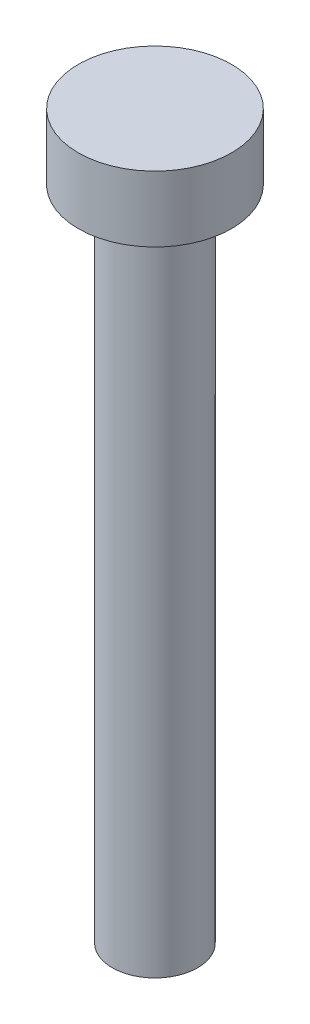
ISO-10303-21;
HEADER;
FILE_DESCRIPTION(('STEP AP214'),'2;1');
FILE_NAME('part.step','',(''),(''),'','','');
FILE_SCHEMA(('AUTOMOTIVE_DESIGN { 1 0 10303 214 1 1 1 1 }'));
ENDSEC;
DATA;
#1=APPLICATION_CONTEXT('core data for automotive mechanical design processes');
#2=APPLICATION_PROTOCOL_DEFINITION('international standard','automotive_design',2000,#1);
#3=PRODUCT_CONTEXT('',#1,'mechanical');
#4=PRODUCT('Part','Part','',(#3));
#5=PRODUCT_RELATED_PRODUCT_CATEGORY('part','',(#4));
#6=PRODUCT_DEFINITION_FORMATION('','',#4);
#7=PRODUCT_DEFINITION_CONTEXT('part definition',#1,'design');
#8=PRODUCT_DEFINITION('design','',#6,#7);
#9=PRODUCT_DEFINITION_SHAPE('','',#8);
#10=(LENGTH_UNIT() NAMED_UNIT(*) SI_UNIT(.MILLI.,.METRE.));
#11=(NAMED_UNIT(*) PLANE_ANGLE_UNIT() SI_UNIT($,.RADIAN.));
#12=(NAMED_UNIT(*) SI_UNIT($,.STERADIAN.) SOLID_ANGLE_UNIT());
#13=UNCERTAINTY_MEASURE_WITH_UNIT(LENGTH_MEASURE(1.E-05),#10,'distance_accuracy_value','');
#14=(GEOMETRIC_REPRESENTATION_CONTEXT(3) GLOBAL_UNCERTAINTY_ASSIGNED_CONTEXT((#13)) GLOBAL_UNIT_ASSIGNED_CONTEXT((#10,
#11,#12)) REPRESENTATION_CONTEXT('',''));
#15=CARTESIAN_POINT('',(0.,0.,0.));
#16=DIRECTION('',(0.,0.,1.));
#17=DIRECTION('',(1.,0.,0.));
#18=AXIS2_PLACEMENT_3D('',#15,#16,#17);
#19=CARTESIAN_POINT('',(0.,3.,0.));
#20=DIRECTION('',(0.,-1.,0.));
#21=DIRECTION('',(0.,0.,-1.));
#22=AXIS2_PLACEMENT_3D('',#19,#20,#21);
#23=CYLINDRICAL_SURFACE('',#22,3.5);
#24=CARTESIAN_POINT('',(0.,3.,0.));
#25=DIRECTION('',(0.,1.,0.));
#26=DIRECTION('',(0.,0.,1.));
#27=AXIS2_PLACEMENT_3D('',#24,#25,#26);
#28=CIRCLE('',#27,3.5);
#29=CARTESIAN_POINT('',(0.,3.,3.5));
#30=VERTEX_POINT('',#29);
#31=EDGE_CURVE('E39',#30,#30,#28,.T.);
#32=ORIENTED_EDGE('',*,*,#31,.F.);
#33=EDGE_LOOP('',(#32));
#34=FACE_BOUND('',#33,.T.);
#35=CARTESIAN_POINT('',(0.,0.,0.));
#36=DIRECTION('',(0.,1.,0.));
#37=DIRECTION('',(0.,0.,1.));
#38=AXIS2_PLACEMENT_3D('',#35,#36,#37);
#39=CIRCLE('',#38,3.5);
#40=CARTESIAN_POINT('',(0.,0.,3.5));
#41=VERTEX_POINT('',#40);
#42=EDGE_CURVE('E35',#41,#41,#39,.T.);
#43=ORIENTED_EDGE('',*,*,#42,.T.);
#44=EDGE_LOOP('',(#43));
#45=FACE_BOUND('',#44,.T.);
#46=ADVANCED_FACE('F32',(#34,#45),#23,.T.);
#47=CARTESIAN_POINT('',(0.,3.,0.));
#48=DIRECTION('',(0.,1.,0.));
#49=DIRECTION('',(0.,0.,1.));
#50=AXIS2_PLACEMENT_3D('',#47,#48,#49);
#51=PLANE('',#50);
#52=ORIENTED_EDGE('',*,*,#31,.T.);
#53=EDGE_LOOP('',(#52));
#54=FACE_BOUND('',#53,.T.);
#55=ADVANCED_FACE('F56',(#54),#51,.T.);
#56=CARTESIAN_POINT('',(0.,0.,0.));
#57=DIRECTION('',(0.,1.,0.));
#58=DIRECTION('',(0.,0.,1.));
#59=AXIS2_PLACEMENT_3D('',#56,#57,#58);
#60=PLANE('',#59);
#61=CARTESIAN_POINT('',(0.,0.,0.));
#62=DIRECTION('',(0.,-1.,0.));
#63=DIRECTION('',(0.,0.,-1.));
#64=AXIS2_PLACEMENT_3D('',#61,#62,#63);
#65=CIRCLE('',#64,1.95);
#66=CARTESIAN_POINT('',(0.,0.,-1.95));
#67=VERTEX_POINT('',#66);
#68=EDGE_CURVE('E10',#67,#67,#65,.T.);
#69=ORIENTED_EDGE('',*,*,#68,.F.);
#70=EDGE_LOOP('',(#69));
#71=FACE_BOUND('',#70,.T.);
#72=ORIENTED_EDGE('',*,*,#42,.F.);
#73=EDGE_LOOP('',(#72));
#74=FACE_BOUND('',#73,.T.);
#75=ADVANCED_FACE('F53',(#71,#74),#60,.F.);
#76=CARTESIAN_POINT('',(0.,-30.,0.));
#77=DIRECTION('',(0.,1.,0.));
#78=DIRECTION('',(0.,0.,1.));
#79=AXIS2_PLACEMENT_3D('',#76,#77,#78);
#80=CYLINDRICAL_SURFACE('',#79,1.95);
#81=CARTESIAN_POINT('',(0.,-30.,0.));
#82=DIRECTION('',(0.,-1.,0.));
#83=DIRECTION('',(0.,0.,-1.));
#84=AXIS2_PLACEMENT_3D('',#81,#82,#83);
#85=CIRCLE('',#84,1.95);
#86=CARTESIAN_POINT('',(0.,-30.,-1.95));
#87=VERTEX_POINT('',#86);
#88=EDGE_CURVE('E45',#87,#87,#85,.T.);
#89=ORIENTED_EDGE('',*,*,#88,.F.);
#90=EDGE_LOOP('',(#89));
#91=FACE_BOUND('',#90,.T.);
#92=ORIENTED_EDGE('',*,*,#68,.T.);
#93=EDGE_LOOP('',(#92));
#94=FACE_BOUND('',#93,.T.);
#95=ADVANCED_FACE('F55',(#91,#94),#80,.T.);
#96=CARTESIAN_POINT('',(0.,-30.,0.));
#97=DIRECTION('',(0.,-1.,0.));
#98=DIRECTION('',(0.,0.,-1.));
#99=AXIS2_PLACEMENT_3D('',#96,#97,#98);
#100=PLANE('',#99);
#101=ORIENTED_EDGE('',*,*,#88,.T.);
#102=EDGE_LOOP('',(#101));
#103=FACE_BOUND('',#102,.T.);
#104=ADVANCED_FACE('F62',(#103),#100,.T.);
#105=CLOSED_SHELL('',(#46,#55,#75,#95,#104));
#106=MANIFOLD_SOLID_BREP('B2',#105);
#107=ADVANCED_BREP_SHAPE_REPRESENTATION('',(#18,#106),#14);
#108=SHAPE_DEFINITION_REPRESENTATION(#9,#107);
ENDSEC;
END-ISO-10303-21;
